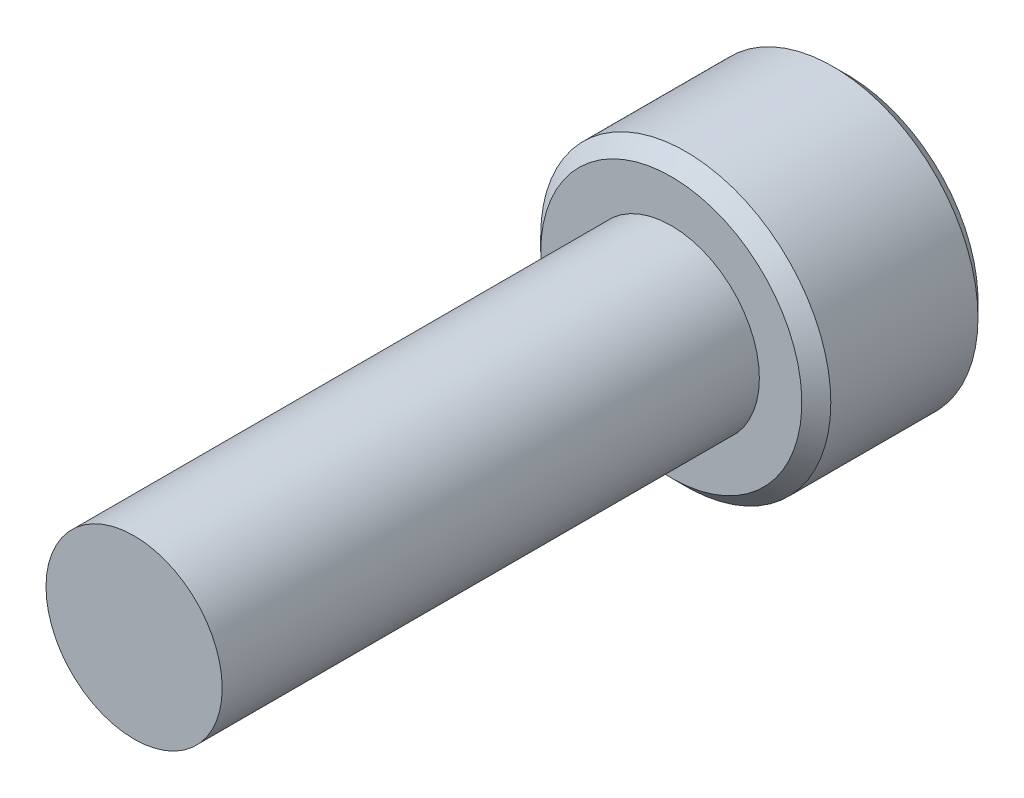
ISO-10303-21;
HEADER;
FILE_DESCRIPTION(('STEP AP214'),'2;1');
FILE_NAME('part.step','',(''),(''),'','','');
FILE_SCHEMA(('AUTOMOTIVE_DESIGN { 1 0 10303 214 1 1 1 1 }'));
ENDSEC;
DATA;
#1=APPLICATION_CONTEXT('core data for automotive mechanical design processes');
#2=APPLICATION_PROTOCOL_DEFINITION('international standard','automotive_design',2000,#1);
#3=PRODUCT_CONTEXT('',#1,'mechanical');
#4=PRODUCT('Part','Part','',(#3));
#5=PRODUCT_RELATED_PRODUCT_CATEGORY('part','',(#4));
#6=PRODUCT_DEFINITION_FORMATION('','',#4);
#7=PRODUCT_DEFINITION_CONTEXT('part definition',#1,'design');
#8=PRODUCT_DEFINITION('design','',#6,#7);
#9=PRODUCT_DEFINITION_SHAPE('','',#8);
#10=(LENGTH_UNIT() NAMED_UNIT(*) SI_UNIT(.MILLI.,.METRE.));
#11=(NAMED_UNIT(*) PLANE_ANGLE_UNIT() SI_UNIT($,.RADIAN.));
#12=(NAMED_UNIT(*) SI_UNIT($,.STERADIAN.) SOLID_ANGLE_UNIT());
#13=UNCERTAINTY_MEASURE_WITH_UNIT(LENGTH_MEASURE(1.E-05),#10,'distance_accuracy_value','');
#14=(GEOMETRIC_REPRESENTATION_CONTEXT(3) GLOBAL_UNCERTAINTY_ASSIGNED_CONTEXT((#13)) GLOBAL_UNIT_ASSIGNED_CONTEXT((#10,
#11,#12)) REPRESENTATION_CONTEXT('',''));
#15=CARTESIAN_POINT('',(0.,0.,0.));
#16=DIRECTION('',(0.,0.,1.));
#17=DIRECTION('',(1.,0.,0.));
#18=AXIS2_PLACEMENT_3D('',#15,#16,#17);
#19=CARTESIAN_POINT('',(0.,0.,-12.7));
#20=DIRECTION('',(0.,0.,1.));
#21=DIRECTION('',(1.,0.,0.));
#22=AXIS2_PLACEMENT_3D('',#19,#20,#21);
#23=CYLINDRICAL_SURFACE('',#22,2.0828);
#24=CARTESIAN_POINT('',(0.,0.,-12.7));
#25=DIRECTION('',(0.,0.,-1.));
#26=DIRECTION('',(-1.,0.,0.));
#27=AXIS2_PLACEMENT_3D('',#24,#25,#26);
#28=CIRCLE('',#27,2.0828);
#29=CARTESIAN_POINT('',(-2.0828,0.,-12.7));
#30=VERTEX_POINT('',#29);
#31=EDGE_CURVE('E200',#30,#30,#28,.F.);
#32=ORIENTED_EDGE('',*,*,#31,.T.);
#33=EDGE_LOOP('',(#32));
#34=FACE_BOUND('',#33,.T.);
#35=CARTESIAN_POINT('',(0.,0.,0.));
#36=DIRECTION('',(0.,0.,1.));
#37=DIRECTION('',(1.,0.,0.));
#38=AXIS2_PLACEMENT_3D('',#35,#36,#37);
#39=CIRCLE('',#38,2.0828);
#40=CARTESIAN_POINT('',(2.0828,0.,0.));
#41=VERTEX_POINT('',#40);
#42=EDGE_CURVE('E106',#41,#41,#39,.T.);
#43=ORIENTED_EDGE('',*,*,#42,.F.);
#44=EDGE_LOOP('',(#43));
#45=FACE_BOUND('',#44,.T.);
#46=ADVANCED_FACE('F32',(#34,#45),#23,.T.);
#47=CARTESIAN_POINT('',(0.,0.,0.));
#48=DIRECTION('',(0.,0.,1.));
#49=DIRECTION('',(1.,0.,0.));
#50=AXIS2_PLACEMENT_3D('',#47,#48,#49);
#51=PLANE('',#50);
#52=ORIENTED_EDGE('',*,*,#42,.T.);
#53=EDGE_LOOP('',(#52));
#54=FACE_BOUND('',#53,.T.);
#55=ADVANCED_FACE('F187',(#54),#51,.T.);
#56=CARTESIAN_POINT('',(0.,0.,-16.8656));
#57=DIRECTION('',(0.,0.,1.));
#58=DIRECTION('',(1.,0.,0.));
#59=AXIS2_PLACEMENT_3D('',#56,#57,#58);
#60=CYLINDRICAL_SURFACE('',#59,3.429);
#61=CARTESIAN_POINT('',(0.,0.,-16.5227));
#62=DIRECTION('',(0.,0.,-1.));
#63=DIRECTION('',(-1.,0.,0.));
#64=AXIS2_PLACEMENT_3D('',#61,#62,#63);
#65=CIRCLE('',#64,3.429);
#66=CARTESIAN_POINT('',(-3.429,0.,-16.5227));
#67=VERTEX_POINT('',#66);
#68=EDGE_CURVE('E40',#67,#67,#65,.F.);
#69=ORIENTED_EDGE('',*,*,#68,.T.);
#70=EDGE_LOOP('',(#69));
#71=FACE_BOUND('',#70,.T.);
#72=CARTESIAN_POINT('',(0.,0.,-13.0429));
#73=DIRECTION('',(0.,0.,-1.));
#74=DIRECTION('',(-1.,0.,0.));
#75=AXIS2_PLACEMENT_3D('',#72,#73,#74);
#76=CIRCLE('',#75,3.429);
#77=CARTESIAN_POINT('',(-3.429,0.,-13.0429));
#78=VERTEX_POINT('',#77);
#79=EDGE_CURVE('E166',#78,#78,#76,.T.);
#80=ORIENTED_EDGE('',*,*,#79,.T.);
#81=EDGE_LOOP('',(#80));
#82=FACE_BOUND('',#81,.T.);
#83=ADVANCED_FACE('F171',(#71,#82),#60,.T.);
#84=CARTESIAN_POINT('',(0.,0.,-16.8656));
#85=DIRECTION('',(0.,0.,-1.));
#86=DIRECTION('',(-1.,0.,0.));
#87=AXIS2_PLACEMENT_3D('',#84,#85,#86);
#88=PLANE('',#87);
#89=CARTESIAN_POINT('',(0.,0.,-16.8656));
#90=DIRECTION('',(0.,0.,-1.));
#91=DIRECTION('',(-1.,0.,0.));
#92=AXIS2_PLACEMENT_3D('',#89,#90,#91);
#93=CIRCLE('',#92,3.0861);
#94=CARTESIAN_POINT('',(-3.0861,0.,-16.8656));
#95=VERTEX_POINT('',#94);
#96=EDGE_CURVE('E105',#95,#95,#93,.T.);
#97=ORIENTED_EDGE('',*,*,#96,.T.);
#98=EDGE_LOOP('',(#97));
#99=FACE_BOUND('',#98,.T.);
#100=CARTESIAN_POINT('',(0.,0.,-16.8656));
#101=DIRECTION('',(0.,0.,-1.));
#102=DIRECTION('',(-1.,0.,0.));
#103=AXIS2_PLACEMENT_3D('',#100,#101,#102);
#104=CIRCLE('',#103,2.06222299276169);
#105=CARTESIAN_POINT('',(-1.7859375,1.03111149638085,-16.8656));
#106=VERTEX_POINT('',#105);
#107=CARTESIAN_POINT('',(0.,2.06222299276169,-16.8656));
#108=VERTEX_POINT('',#107);
#109=EDGE_CURVE('E86',#106,#108,#104,.T.);
#110=ORIENTED_EDGE('',*,*,#109,.F.);
#111=CARTESIAN_POINT('',(-1.7859375,-1.03111149638085,-16.8656));
#112=VERTEX_POINT('',#111);
#113=EDGE_CURVE('E46',#112,#106,#104,.T.);
#114=ORIENTED_EDGE('',*,*,#113,.F.);
#115=CARTESIAN_POINT('',(0.,-2.06222299276169,-16.8656));
#116=VERTEX_POINT('',#115);
#117=EDGE_CURVE('E256',#116,#112,#104,.T.);
#118=ORIENTED_EDGE('',*,*,#117,.F.);
#119=CARTESIAN_POINT('',(1.7859375,-1.03111149638085,-16.8656));
#120=VERTEX_POINT('',#119);
#121=EDGE_CURVE('E53',#120,#116,#104,.T.);
#122=ORIENTED_EDGE('',*,*,#121,.F.);
#123=CARTESIAN_POINT('',(1.7859375,1.03111149638085,-16.8656));
#124=VERTEX_POINT('',#123);
#125=EDGE_CURVE('E127',#124,#120,#104,.T.);
#126=ORIENTED_EDGE('',*,*,#125,.F.);
#127=EDGE_CURVE('E95',#108,#124,#104,.T.);
#128=ORIENTED_EDGE('',*,*,#127,.F.);
#129=EDGE_LOOP('',(#110,#114,#118,#122,#126,#128));
#130=FACE_BOUND('',#129,.T.);
#131=ADVANCED_FACE('F126',(#99,#130),#88,.T.);
#132=CARTESIAN_POINT('',(0.,0.,-12.7));
#133=DIRECTION('',(0.,0.,-1.));
#134=DIRECTION('',(-1.,0.,0.));
#135=AXIS2_PLACEMENT_3D('',#132,#133,#134);
#136=PLANE('',#135);
#137=CARTESIAN_POINT('',(0.,0.,-12.7));
#138=DIRECTION('',(0.,0.,-1.));
#139=DIRECTION('',(-1.,0.,0.));
#140=AXIS2_PLACEMENT_3D('',#137,#138,#139);
#141=CIRCLE('',#140,3.0861);
#142=CARTESIAN_POINT('',(-3.0861,0.,-12.7));
#143=VERTEX_POINT('',#142);
#144=EDGE_CURVE('E11',#143,#143,#141,.F.);
#145=ORIENTED_EDGE('',*,*,#144,.T.);
#146=EDGE_LOOP('',(#145));
#147=FACE_BOUND('',#146,.T.);
#148=ORIENTED_EDGE('',*,*,#31,.F.);
#149=EDGE_LOOP('',(#148));
#150=FACE_BOUND('',#149,.T.);
#151=ADVANCED_FACE('F180',(#147,#150),#136,.F.);
#152=CARTESIAN_POINT('',(0.,0.,-16.8656));
#153=DIRECTION('',(0.,0.,-1.));
#154=DIRECTION('',(-1.,0.,0.));
#155=AXIS2_PLACEMENT_3D('',#152,#153,#154);
#156=CONICAL_SURFACE('',#155,2.06222299276169,0.78539816339745);
#157=ORIENTED_EDGE('',*,*,#127,.T.);
#158=CARTESIAN_POINT('',(-0.000199999999999837,2.06233846281553,-16.8657154797516));
#159=CARTESIAN_POINT('',(0.0611956015759165,2.02689169571862,-16.8302968302053));
#160=CARTESIAN_POINT('',(0.123617860874083,1.9908521875094,-16.7969581781509));
#161=CARTESIAN_POINT('',(0.250903960535891,1.91736352360555,-16.7359155592055));
#162=CARTESIAN_POINT('',(0.315779909798269,1.87990737683499,-16.7082455621251));
#163=CARTESIAN_POINT('',(0.446599209311714,1.8043788190457,-16.6608461265527));
#164=CARTESIAN_POINT('',(0.512509233513534,1.76632564883049,-16.6409975342861));
#165=CARTESIAN_POINT('',(0.645780477682402,1.68938146013435,-16.6104164816143));
#166=CARTESIAN_POINT('',(0.713137624857635,1.65049279308089,-16.5996611886412));
#167=CARTESIAN_POINT('',(0.829220820670577,1.58347212872989,-16.5899572559589));
#168=CARTESIAN_POINT('',(0.877796848686671,1.55542674587864,-16.588520545453));
#169=CARTESIAN_POINT('',(0.974869540343765,1.49938180121946,-16.5909394477888));
#170=CARTESIAN_POINT('',(1.02336617019129,1.4713822589222,-16.5947969161715));
#171=CARTESIAN_POINT('',(1.11988817846821,1.4156552514608,-16.6075828827439));
#172=CARTESIAN_POINT('',(1.16791312509815,1.38792803559618,-16.6165156537155));
#173=CARTESIAN_POINT('',(1.26315922323818,1.33293767519577,-16.6389673141422));
#174=CARTESIAN_POINT('',(1.31037998091306,1.30567475804084,-16.652488386438));
#175=CARTESIAN_POINT('',(1.43132294865621,1.23584830305774,-16.6926273746341));
#176=CARTESIAN_POINT('',(1.50429529371242,1.19371769999614,-16.7222707839069));
#177=CARTESIAN_POINT('',(1.61159442773943,1.13176851608183,-16.772313490254));
#178=CARTESIAN_POINT('',(1.64695424171411,1.11135351796506,-16.789896283774));
#179=CARTESIAN_POINT('',(1.71701878052223,1.07090173762355,-16.8266647691481));
#180=CARTESIAN_POINT('',(1.75172389195438,1.05086473219594,-16.845849476289));
#181=CARTESIAN_POINT('',(1.7861375,1.03099602632701,-16.8657154797516));
#182=B_SPLINE_CURVE_WITH_KNOTS('',3,(#158,#159,#160,#161,#162,#163,#164,#165,#166,#167,#168,
#169,#170,#171,#172,#173,#174,#175,#176,#177,#178,#179,#180,#181),.UNSPECIFIED.,.F.,.F.,(4,2,2,
2,2,2,2,2,2,2,2,4),(0.,0.237911140423802,0.47720876767363,0.712705150046278,0.947608448198473,
1.11569769827263,1.28384587649986,1.45213582505427,1.62050594845156,1.88791495712909,
2.02125696737758,2.15451760593925),.UNSPECIFIED.);
#183=EDGE_CURVE('E100',#108,#124,#182,.T.);
#184=ORIENTED_EDGE('',*,*,#183,.F.);
#185=EDGE_LOOP('',(#157,#184));
#186=FACE_BOUND('',#185,.T.);
#187=ADVANCED_FACE('F101',(#186),#156,.F.);
#188=ORIENTED_EDGE('',*,*,#125,.T.);
#189=CARTESIAN_POINT('',(1.7859375,-2.0564571794204,-17.5270856709349));
#190=CARTESIAN_POINT('',(1.7859375,-2.00638471909862,-17.4892880169957));
#191=CARTESIAN_POINT('',(1.7859375,-1.9560318889355,-17.4518564486687));
#192=CARTESIAN_POINT('',(1.7859375,-1.85465493232354,-17.3778876153243));
#193=CARTESIAN_POINT('',(1.7859375,-1.80363064053091,-17.3413505771645));
#194=CARTESIAN_POINT('',(1.7859375,-1.7004269625614,-17.2690731528572));
#195=CARTESIAN_POINT('',(1.7859375,-1.64824168967413,-17.233341132932));
#196=CARTESIAN_POINT('',(1.7859375,-1.54298521924056,-17.1632166560612));
#197=CARTESIAN_POINT('',(1.7859375,-1.48991408466505,-17.1288241044749));
#198=CARTESIAN_POINT('',(1.7859375,-1.32304925075432,-17.0242275506123));
#199=CARTESIAN_POINT('',(1.7859375,-1.20747518485095,-16.9568130981851));
#200=CARTESIAN_POINT('',(1.7859375,-0.970563462349316,-16.8334971938958));
#201=CARTESIAN_POINT('',(1.7859375,-0.849247003266681,-16.7775569298341));
#202=CARTESIAN_POINT('',(1.7859375,-0.667147590400393,-16.7091193208198));
#203=CARTESIAN_POINT('',(1.7859375,-0.609061867992985,-16.6894772551934));
#204=CARTESIAN_POINT('',(1.7859375,-0.491488306301484,-16.654856417184));
#205=CARTESIAN_POINT('',(1.7859375,-0.432000370727959,-16.639877966059));
#206=CARTESIAN_POINT('',(1.7859375,-0.312971553025677,-16.6156118427828));
#207=CARTESIAN_POINT('',(1.7859375,-0.253450864331209,-16.6062266687623));
#208=CARTESIAN_POINT('',(1.7859375,-0.133772958047114,-16.5933303326389));
#209=CARTESIAN_POINT('',(1.7859375,-0.0736158516653908,-16.5898181608047));
#210=CARTESIAN_POINT('',(1.7859375,0.0445641075801582,-16.5889283461994));
#211=CARTESIAN_POINT('',(1.7859375,0.102585397592693,-16.5913332609875));
#212=CARTESIAN_POINT('',(1.7859375,0.218130764261559,-16.6016652894478));
#213=CARTESIAN_POINT('',(1.7859375,0.275654792066328,-16.6095929395753));
#214=CARTESIAN_POINT('',(1.7859375,0.390762936235965,-16.6306721191996));
#215=CARTESIAN_POINT('',(1.7859375,0.448330524172478,-16.6439125456089));
#216=CARTESIAN_POINT('',(1.7859375,0.562208055257706,-16.6749135632709));
#217=CARTESIAN_POINT('',(1.7859375,0.618518103209719,-16.6926737763043));
#218=CARTESIAN_POINT('',(1.7859375,0.795802935443479,-16.7552710135077));
#219=CARTESIAN_POINT('',(1.7859375,0.914253068308211,-16.8072371701309));
#220=CARTESIAN_POINT('',(1.7859375,1.14559793318386,-16.9227773029299));
#221=CARTESIAN_POINT('',(1.7859375,1.25847079443432,-16.9863929824275));
#222=CARTESIAN_POINT('',(1.7859375,1.42161019191199,-17.0856649974319));
#223=CARTESIAN_POINT('',(1.7859375,1.47364444169481,-17.1184728465278));
#224=CARTESIAN_POINT('',(1.7859375,1.57681993847581,-17.1854743669625));
#225=CARTESIAN_POINT('',(1.7859375,1.62796111741225,-17.2196681432703));
#226=CARTESIAN_POINT('',(1.7859375,1.7290523077583,-17.2889049280038));
#227=CARTESIAN_POINT('',(1.7859375,1.77900862061028,-17.3239387817349));
#228=CARTESIAN_POINT('',(1.7859375,1.8782385364545,-17.3949329715092));
#229=CARTESIAN_POINT('',(1.7859375,1.92751232341313,-17.4308930501216));
#230=CARTESIAN_POINT('',(1.7859375,1.9765003414196,-17.4672325501569));
#231=B_SPLINE_CURVE_WITH_KNOTS('',3,(#189,#190,#191,#192,#193,#194,#195,#196,#197,#198,#199,
#200,#201,#202,#203,#204,#205,#206,#207,#208,#209,#210,#211,#212,#213,#214,#215,#216,#217,#218,
#219,#220,#221,#222,#223,#224,#225,#226,#227,#228,#229,#230),.UNSPECIFIED.,.F.,.F.,(4,2,2,2,2,2,
2,2,2,2,2,2,2,2,2,2,2,2,2,2,4),(0.,0.188213463007492,0.376474173620914,0.566193581980197,
0.75589956123407,1.15694956004514,1.55661975691516,1.74041450774975,1.92422191668029,
2.104723615629,2.28519427815575,2.45913267060715,2.63308796106198,2.81008419387739,
2.9870656203721,3.37397665720655,3.76230085312826,3.94682415462261,4.13136145796745,
4.31439974248597,4.49738769171718),.UNSPECIFIED.);
#232=EDGE_CURVE('E94',#124,#120,#231,.F.);
#233=ORIENTED_EDGE('',*,*,#232,.F.);
#234=EDGE_LOOP('',(#188,#233));
#235=FACE_BOUND('',#234,.T.);
#236=ADVANCED_FACE('F262',(#235),#156,.F.);
#237=ORIENTED_EDGE('',*,*,#121,.T.);
#238=CARTESIAN_POINT('',(1.7861375,-1.03099602632701,-16.8657154797516));
#239=CARTESIAN_POINT('',(1.72474189842408,-1.06644279342392,-16.8302968302053));
#240=CARTESIAN_POINT('',(1.66231963912592,-1.10248230163314,-16.7969581781509));
#241=CARTESIAN_POINT('',(1.53503353946411,-1.17597096553699,-16.7359155592055));
#242=CARTESIAN_POINT('',(1.47015759020173,-1.21342711230755,-16.7082455621251));
#243=CARTESIAN_POINT('',(1.33933829068829,-1.28895567009684,-16.6608461265528));
#244=CARTESIAN_POINT('',(1.27342826648647,-1.32700884031206,-16.6409975342861));
#245=CARTESIAN_POINT('',(1.1401570223176,-1.40395302900819,-16.6104164816143));
#246=CARTESIAN_POINT('',(1.07279987514237,-1.44284169606165,-16.5996611886412));
#247=CARTESIAN_POINT('',(0.956716679329423,-1.50986236041265,-16.5899572559589));
#248=CARTESIAN_POINT('',(0.908140651313329,-1.5379077432639,-16.588520545453));
#249=CARTESIAN_POINT('',(0.811067959656236,-1.59395268792309,-16.5909394477888));
#250=CARTESIAN_POINT('',(0.762571329808712,-1.62195223022034,-16.5947969161715));
#251=CARTESIAN_POINT('',(0.666049321531796,-1.67767923768175,-16.6075828827439));
#252=CARTESIAN_POINT('',(0.618024374901855,-1.70540645354636,-16.6165156537155));
#253=CARTESIAN_POINT('',(0.522778276761816,-1.76039681394677,-16.6389673141422));
#254=CARTESIAN_POINT('',(0.475557519086938,-1.7876597311017,-16.652488386438));
#255=CARTESIAN_POINT('',(0.354614551343791,-1.8574861860848,-16.6926273746341));
#256=CARTESIAN_POINT('',(0.281642206287579,-1.8996167891464,-16.7222707839069));
#257=CARTESIAN_POINT('',(0.17434307226057,-1.96156597306071,-16.772313490254));
#258=CARTESIAN_POINT('',(0.138983258285892,-1.98198097117748,-16.789896283774));
#259=CARTESIAN_POINT('',(0.0689187194777749,-2.022432751519,-16.8266647691481));
#260=CARTESIAN_POINT('',(0.0342136080456218,-2.04246975694661,-16.845849476289));
#261=CARTESIAN_POINT('',(-0.000199999999999378,-2.06233846281553,-16.8657154797516));
#262=B_SPLINE_CURVE_WITH_KNOTS('',3,(#238,#239,#240,#241,#242,#243,#244,#245,#246,#247,#248,
#249,#250,#251,#252,#253,#254,#255,#256,#257,#258,#259,#260,#261),.UNSPECIFIED.,.F.,.F.,(4,2,2,
2,2,2,2,2,2,2,2,4),(0.,0.237911140423801,0.477208767673629,0.712705150046278,0.947608448198473,
1.11569769827263,1.28384587649986,1.45213582505427,1.62050594845156,1.88791495712909,
2.02125696737758,2.15451760593925),.UNSPECIFIED.);
#263=EDGE_CURVE('E136',#120,#116,#262,.T.);
#264=ORIENTED_EDGE('',*,*,#263,.F.);
#265=EDGE_LOOP('',(#237,#264));
#266=FACE_BOUND('',#265,.T.);
#267=ADVANCED_FACE('F259',(#266),#156,.F.);
#268=ORIENTED_EDGE('',*,*,#117,.T.);
#269=CARTESIAN_POINT('',(0.00020000000000003,-2.06233846281553,-16.8657154797516));
#270=CARTESIAN_POINT('',(-0.0611956015759167,-2.02689169571862,-16.8302968302053));
#271=CARTESIAN_POINT('',(-0.123617860874083,-1.9908521875094,-16.7969581781509));
#272=CARTESIAN_POINT('',(-0.250903960535891,-1.91736352360555,-16.7359155592055));
#273=CARTESIAN_POINT('',(-0.315779909798269,-1.87990737683499,-16.7082455621251));
#274=CARTESIAN_POINT('',(-0.446599209311714,-1.8043788190457,-16.6608461265527));
#275=CARTESIAN_POINT('',(-0.512509233513534,-1.76632564883049,-16.6409975342861));
#276=CARTESIAN_POINT('',(-0.645780477682402,-1.68938146013435,-16.6104164816143));
#277=CARTESIAN_POINT('',(-0.713137624857635,-1.65049279308089,-16.5996611886412));
#278=CARTESIAN_POINT('',(-0.829220820670577,-1.58347212872989,-16.5899572559589));
#279=CARTESIAN_POINT('',(-0.877796848686671,-1.55542674587864,-16.588520545453));
#280=CARTESIAN_POINT('',(-0.974869540343765,-1.49938180121946,-16.5909394477888));
#281=CARTESIAN_POINT('',(-1.02336617019129,-1.4713822589222,-16.5947969161715));
#282=CARTESIAN_POINT('',(-1.11988817846821,-1.4156552514608,-16.6075828827439));
#283=CARTESIAN_POINT('',(-1.16791312509815,-1.38792803559618,-16.6165156537155));
#284=CARTESIAN_POINT('',(-1.26315922323818,-1.33293767519577,-16.6389673141422));
#285=CARTESIAN_POINT('',(-1.31037998091306,-1.30567475804084,-16.652488386438));
#286=CARTESIAN_POINT('',(-1.43132294865621,-1.23584830305774,-16.6926273746341));
#287=CARTESIAN_POINT('',(-1.50429529371242,-1.19371769999614,-16.7222707839069));
#288=CARTESIAN_POINT('',(-1.61159442773943,-1.13176851608183,-16.772313490254));
#289=CARTESIAN_POINT('',(-1.64695424171411,-1.11135351796506,-16.789896283774));
#290=CARTESIAN_POINT('',(-1.71701878052223,-1.07090173762355,-16.8266647691481));
#291=CARTESIAN_POINT('',(-1.75172389195438,-1.05086473219594,-16.845849476289));
#292=CARTESIAN_POINT('',(-1.7861375,-1.03099602632701,-16.8657154797516));
#293=B_SPLINE_CURVE_WITH_KNOTS('',3,(#269,#270,#271,#272,#273,#274,#275,#276,#277,#278,#279,
#280,#281,#282,#283,#284,#285,#286,#287,#288,#289,#290,#291,#292),.UNSPECIFIED.,.F.,.F.,(4,2,2,
2,2,2,2,2,2,2,2,4),(0.,0.237911140423802,0.47720876767363,0.712705150046278,0.947608448198473,
1.11569769827263,1.28384587649986,1.45213582505427,1.62050594845156,1.88791495712909,
2.02125696737758,2.15451760593925),.UNSPECIFIED.);
#294=EDGE_CURVE('E234',#116,#112,#293,.T.);
#295=ORIENTED_EDGE('',*,*,#294,.F.);
#296=EDGE_LOOP('',(#268,#295));
#297=FACE_BOUND('',#296,.T.);
#298=ADVANCED_FACE('F258',(#297),#156,.F.);
#299=ORIENTED_EDGE('',*,*,#113,.T.);
#300=CARTESIAN_POINT('',(-1.7859375,-2.05645717971961,-17.5270856711608));
#301=CARTESIAN_POINT('',(-1.7859375,-2.00638471938943,-17.4892880172129));
#302=CARTESIAN_POINT('',(-1.7859375,-1.95603188921789,-17.4518564488772));
#303=CARTESIAN_POINT('',(-1.7859375,-1.854654932589,-17.3778876155155));
#304=CARTESIAN_POINT('',(-1.7859375,-1.80363064078787,-17.3413505773471));
#305=CARTESIAN_POINT('',(-1.7859375,-1.70042696280105,-17.2690731530224));
#306=CARTESIAN_POINT('',(-1.7859375,-1.64824168990499,-17.2333411330885));
#307=CARTESIAN_POINT('',(-1.7859375,-1.54298521945367,-17.1632166562004));
#308=CARTESIAN_POINT('',(-1.7859375,-1.4899140848692,-17.1288241046057));
#309=CARTESIAN_POINT('',(-1.7859375,-1.32304925092892,-17.0242275507158));
#310=CARTESIAN_POINT('',(-1.7859375,-1.20747518500455,-16.9568130982705));
#311=CARTESIAN_POINT('',(-1.7859375,-0.970563462459106,-16.8334971939475));
#312=CARTESIAN_POINT('',(-1.7859375,-0.849247003353688,-16.7775569298703));
#313=CARTESIAN_POINT('',(-1.7859375,-0.667147590470259,-16.7091193208444));
#314=CARTESIAN_POINT('',(-1.7859375,-0.609061868070028,-16.6894772552185));
#315=CARTESIAN_POINT('',(-1.7859375,-0.491488306393119,-16.6548564172086));
#316=CARTESIAN_POINT('',(-1.7859375,-0.432000370827006,-16.6398779660825));
#317=CARTESIAN_POINT('',(-1.7859375,-0.312971553139305,-16.6156118428026));
#318=CARTESIAN_POINT('',(-1.7859375,-0.253450864452002,-16.6062266687795));
#319=CARTESIAN_POINT('',(-1.7859375,-0.133772958181996,-16.5933303326493));
#320=CARTESIAN_POINT('',(-1.7859375,-0.0736158518071977,-16.5898181608107));
#321=CARTESIAN_POINT('',(-1.7859375,0.0445641074255746,-16.5889283461957));
#322=CARTESIAN_POINT('',(-1.7859375,0.102585397432239,-16.5913332609785));
#323=CARTESIAN_POINT('',(-1.7859375,0.218130764089954,-16.6016652894271));
#324=CARTESIAN_POINT('',(-1.7859375,0.27565479188944,-16.6095929395484));
#325=CARTESIAN_POINT('',(-1.7859375,0.390762936048649,-16.6306721191597));
#326=CARTESIAN_POINT('',(-1.7859375,0.448330523980032,-16.6439125455621));
#327=CARTESIAN_POINT('',(-1.7859375,0.562208055055495,-16.6749135632103));
#328=CARTESIAN_POINT('',(-1.7859375,0.618518103002873,-16.6926737762366));
#329=CARTESIAN_POINT('',(-1.7859375,0.795802935191591,-16.755271013407));
#330=CARTESIAN_POINT('',(-1.7859375,0.914253068018178,-16.8072371699997));
#331=CARTESIAN_POINT('',(-1.7859375,1.14559793282046,-16.9227773027346));
#332=CARTESIAN_POINT('',(-1.7859375,1.25847079403572,-16.9863929821984));
#333=CARTESIAN_POINT('',(-1.7859375,1.42161019146454,-17.0856649971533));
#334=CARTESIAN_POINT('',(-1.7859375,1.47364444123306,-17.118472846234));
#335=CARTESIAN_POINT('',(-1.7859375,1.57681993798568,-17.1854743666382));
#336=CARTESIAN_POINT('',(-1.7859375,1.62796111690803,-17.2196681429306));
#337=CARTESIAN_POINT('',(-1.7859375,1.72905230722623,-17.2889049276337));
#338=CARTESIAN_POINT('',(-1.7859375,1.77900862006446,-17.3239387813497));
#339=CARTESIAN_POINT('',(-1.7859375,1.87823853588126,-17.3949329710938));
#340=CARTESIAN_POINT('',(-1.7859375,1.92751232282623,-17.4308930496911));
#341=CARTESIAN_POINT('',(-1.7859375,1.97650034081906,-17.4672325497113));
#342=B_SPLINE_CURVE_WITH_KNOTS('',3,(#300,#301,#302,#303,#304,#305,#306,#307,#308,#309,#310,
#311,#312,#313,#314,#315,#316,#317,#318,#319,#320,#321,#322,#323,#324,#325,#326,#327,#328,#329,
#330,#331,#332,#333,#334,#335,#336,#337,#338,#339,#340,#341),.UNSPECIFIED.,.F.,.F.,(4,2,2,2,2,2,
2,2,2,2,2,2,2,2,2,2,2,2,2,2,4),(0.,0.188213463043314,0.376474173692571,0.566193582088359,
0.755899561378738,1.15694956027169,1.5566197572228,1.74041450803663,1.92422191694645,
2.10472361587529,2.28519427838217,2.45913267081537,2.63308796125199,2.8100841940478,
2.98706562052293,3.37397665721653,3.76230085299648,3.94682415443018,4.13136145771436,
4.31439974217306,4.49738769134445),.UNSPECIFIED.);
#343=EDGE_CURVE('E116',#112,#106,#342,.T.);
#344=ORIENTED_EDGE('',*,*,#343,.F.);
#345=EDGE_LOOP('',(#299,#344));
#346=FACE_BOUND('',#345,.T.);
#347=ADVANCED_FACE('F271',(#346),#156,.F.);
#348=ORIENTED_EDGE('',*,*,#109,.T.);
#349=CARTESIAN_POINT('',(-1.7861375,1.03099602632701,-16.8657154797516));
#350=CARTESIAN_POINT('',(-1.72474189842408,1.06644279342392,-16.8302968302053));
#351=CARTESIAN_POINT('',(-1.66231963912592,1.10248230163314,-16.7969581781509));
#352=CARTESIAN_POINT('',(-1.53503353946411,1.17597096553699,-16.7359155592055));
#353=CARTESIAN_POINT('',(-1.47015759020173,1.21342711230755,-16.7082455621251));
#354=CARTESIAN_POINT('',(-1.33933829068829,1.28895567009684,-16.6608461265527));
#355=CARTESIAN_POINT('',(-1.27342826648647,1.32700884031205,-16.6409975342861));
#356=CARTESIAN_POINT('',(-1.1401570223176,1.40395302900819,-16.6104164816143));
#357=CARTESIAN_POINT('',(-1.07279987514236,1.44284169606165,-16.5996611886412));
#358=CARTESIAN_POINT('',(-0.956716679329423,1.50986236041265,-16.5899572559589));
#359=CARTESIAN_POINT('',(-0.908140651313328,1.5379077432639,-16.588520545453));
#360=CARTESIAN_POINT('',(-0.811067959656235,1.59395268792309,-16.5909394477888));
#361=CARTESIAN_POINT('',(-0.762571329808711,1.62195223022034,-16.5947969161715));
#362=CARTESIAN_POINT('',(-0.666049321531794,1.67767923768175,-16.6075828827439));
#363=CARTESIAN_POINT('',(-0.618024374901854,1.70540645354636,-16.6165156537155));
#364=CARTESIAN_POINT('',(-0.522778276761816,1.76039681394677,-16.6389673141422));
#365=CARTESIAN_POINT('',(-0.475557519086938,1.7876597311017,-16.652488386438));
#366=CARTESIAN_POINT('',(-0.354614551343791,1.8574861860848,-16.6926273746341));
#367=CARTESIAN_POINT('',(-0.281642206287578,1.8996167891464,-16.7222707839069));
#368=CARTESIAN_POINT('',(-0.174343072260569,1.96156597306071,-16.772313490254));
#369=CARTESIAN_POINT('',(-0.138983258285892,1.98198097117748,-16.789896283774));
#370=CARTESIAN_POINT('',(-0.0689187194777745,2.022432751519,-16.8266647691481));
#371=CARTESIAN_POINT('',(-0.0342136080456212,2.04246975694661,-16.845849476289));
#372=CARTESIAN_POINT('',(0.000199999999999954,2.06233846281553,-16.8657154797516));
#373=B_SPLINE_CURVE_WITH_KNOTS('',3,(#349,#350,#351,#352,#353,#354,#355,#356,#357,#358,#359,
#360,#361,#362,#363,#364,#365,#366,#367,#368,#369,#370,#371,#372),.UNSPECIFIED.,.F.,.F.,(4,2,2,
2,2,2,2,2,2,2,2,4),(0.,0.237911140423802,0.47720876767363,0.712705150046278,0.947608448198473,
1.11569769827263,1.28384587649986,1.45213582505427,1.62050594845156,1.88791495712909,
2.02125696737758,2.15451760593925),.UNSPECIFIED.);
#374=EDGE_CURVE('E90',#106,#108,#373,.T.);
#375=ORIENTED_EDGE('',*,*,#374,.F.);
#376=EDGE_LOOP('',(#348,#375));
#377=FACE_BOUND('',#376,.T.);
#378=ADVANCED_FACE('F88',(#377),#156,.F.);
#379=CARTESIAN_POINT('',(1.7859375,3.09333448914254,-14.18669375));
#380=DIRECTION('',(0.,0.,-1.));
#381=DIRECTION('',(-1.,0.,0.));
#382=AXIS2_PLACEMENT_3D('',#379,#380,#381);
#383=PLANE('',#382);
#384=DIRECTION('',(0.866025403784439,0.5,0.));
#385=VECTOR('',#384,1.);
#386=CARTESIAN_POINT('',(-1.7859375,1.03111149638085,-14.18669375));
#387=LINE('',#386,#385);
#388=CARTESIAN_POINT('',(-1.7859375,1.03111149638085,-14.18669375));
#389=VERTEX_POINT('',#388);
#390=CARTESIAN_POINT('',(0.,2.06222299276169,-14.18669375));
#391=VERTEX_POINT('',#390);
#392=EDGE_CURVE('E115',#389,#391,#387,.T.);
#393=ORIENTED_EDGE('',*,*,#392,.T.);
#394=DIRECTION('',(0.866025403784439,-0.5,0.));
#395=VECTOR('',#394,1.);
#396=CARTESIAN_POINT('',(0.,2.06222299276169,-14.18669375));
#397=LINE('',#396,#395);
#398=CARTESIAN_POINT('',(1.7859375,1.03111149638085,-14.18669375));
#399=VERTEX_POINT('',#398);
#400=EDGE_CURVE('E120',#391,#399,#397,.T.);
#401=ORIENTED_EDGE('',*,*,#400,.T.);
#402=DIRECTION('',(0.,-1.,0.));
#403=VECTOR('',#402,1.);
#404=CARTESIAN_POINT('',(1.7859375,1.03111149638085,-14.18669375));
#405=LINE('',#404,#403);
#406=CARTESIAN_POINT('',(1.7859375,-1.03111149638085,-14.18669375));
#407=VERTEX_POINT('',#406);
#408=EDGE_CURVE('E222',#399,#407,#405,.T.);
#409=ORIENTED_EDGE('',*,*,#408,.T.);
#410=DIRECTION('',(-0.866025403784439,-0.5,0.));
#411=VECTOR('',#410,1.);
#412=CARTESIAN_POINT('',(1.7859375,-1.03111149638085,-14.18669375));
#413=LINE('',#412,#411);
#414=CARTESIAN_POINT('',(0.,-2.06222299276169,-14.18669375));
#415=VERTEX_POINT('',#414);
#416=EDGE_CURVE('E219',#407,#415,#413,.T.);
#417=ORIENTED_EDGE('',*,*,#416,.T.);
#418=DIRECTION('',(-0.866025403784439,0.5,0.));
#419=VECTOR('',#418,1.);
#420=CARTESIAN_POINT('',(0.,-2.06222299276169,-14.18669375));
#421=LINE('',#420,#419);
#422=CARTESIAN_POINT('',(-1.7859375,-1.03111149638085,-14.18669375));
#423=VERTEX_POINT('',#422);
#424=EDGE_CURVE('E216',#415,#423,#421,.T.);
#425=ORIENTED_EDGE('',*,*,#424,.T.);
#426=DIRECTION('',(0.,1.,0.));
#427=VECTOR('',#426,1.);
#428=CARTESIAN_POINT('',(-1.7859375,-1.03111149638085,-14.18669375));
#429=LINE('',#428,#427);
#430=EDGE_CURVE('E123',#423,#389,#429,.T.);
#431=ORIENTED_EDGE('',*,*,#430,.T.);
#432=EDGE_LOOP('',(#393,#401,#409,#417,#425,#431));
#433=FACE_BOUND('',#432,.T.);
#434=ADVANCED_FACE('F155',(#433),#383,.T.);
#435=CARTESIAN_POINT('',(0.,2.06222299276169,-14.18669375));
#436=DIRECTION('',(0.5,0.866025403784439,0.));
#437=DIRECTION('',(-0.866025403784439,0.5,0.));
#438=AXIS2_PLACEMENT_3D('',#435,#436,#437);
#439=PLANE('',#438);
#440=DIRECTION('',(0.,0.,-1.));
#441=VECTOR('',#440,1.);
#442=CARTESIAN_POINT('',(0.,2.06222299276169,-14.18669375));
#443=LINE('',#442,#441);
#444=EDGE_CURVE('E112',#391,#108,#443,.T.);
#445=ORIENTED_EDGE('',*,*,#444,.T.);
#446=ORIENTED_EDGE('',*,*,#183,.T.);
#447=DIRECTION('',(0.,0.,-1.));
#448=VECTOR('',#447,1.);
#449=CARTESIAN_POINT('',(1.7859375,1.03111149638085,-14.18669375));
#450=LINE('',#449,#448);
#451=EDGE_CURVE('E122',#399,#124,#450,.T.);
#452=ORIENTED_EDGE('',*,*,#451,.F.);
#453=ORIENTED_EDGE('',*,*,#400,.F.);
#454=EDGE_LOOP('',(#445,#446,#452,#453));
#455=FACE_BOUND('',#454,.T.);
#456=ADVANCED_FACE('F118',(#455),#439,.F.);
#457=CARTESIAN_POINT('',(1.7859375,1.03111149638085,-14.18669375));
#458=DIRECTION('',(1.,0.,0.));
#459=DIRECTION('',(0.,1.,0.));
#460=AXIS2_PLACEMENT_3D('',#457,#458,#459);
#461=PLANE('',#460);
#462=ORIENTED_EDGE('',*,*,#451,.T.);
#463=ORIENTED_EDGE('',*,*,#232,.T.);
#464=DIRECTION('',(0.,0.,-1.));
#465=VECTOR('',#464,1.);
#466=CARTESIAN_POINT('',(1.7859375,-1.03111149638085,-14.18669375));
#467=LINE('',#466,#465);
#468=EDGE_CURVE('E207',#407,#120,#467,.T.);
#469=ORIENTED_EDGE('',*,*,#468,.F.);
#470=ORIENTED_EDGE('',*,*,#408,.F.);
#471=EDGE_LOOP('',(#462,#463,#469,#470));
#472=FACE_BOUND('',#471,.T.);
#473=ADVANCED_FACE('F144',(#472),#461,.F.);
#474=CARTESIAN_POINT('',(1.7859375,-1.03111149638085,-14.18669375));
#475=DIRECTION('',(0.5,-0.866025403784439,0.));
#476=DIRECTION('',(0.866025403784439,0.5,0.));
#477=AXIS2_PLACEMENT_3D('',#474,#475,#476);
#478=PLANE('',#477);
#479=ORIENTED_EDGE('',*,*,#468,.T.);
#480=ORIENTED_EDGE('',*,*,#263,.T.);
#481=DIRECTION('',(0.,0.,-1.));
#482=VECTOR('',#481,1.);
#483=CARTESIAN_POINT('',(0.,-2.06222299276169,-14.18669375));
#484=LINE('',#483,#482);
#485=EDGE_CURVE('E210',#415,#116,#484,.T.);
#486=ORIENTED_EDGE('',*,*,#485,.F.);
#487=ORIENTED_EDGE('',*,*,#416,.F.);
#488=EDGE_LOOP('',(#479,#480,#486,#487));
#489=FACE_BOUND('',#488,.T.);
#490=ADVANCED_FACE('F148',(#489),#478,.F.);
#491=CARTESIAN_POINT('',(0.,-2.06222299276169,-14.18669375));
#492=DIRECTION('',(-0.5,-0.866025403784439,0.));
#493=DIRECTION('',(0.866025403784439,-0.5,0.));
#494=AXIS2_PLACEMENT_3D('',#491,#492,#493);
#495=PLANE('',#494);
#496=ORIENTED_EDGE('',*,*,#485,.T.);
#497=ORIENTED_EDGE('',*,*,#294,.T.);
#498=DIRECTION('',(0.,0.,-1.));
#499=VECTOR('',#498,1.);
#500=CARTESIAN_POINT('',(-1.7859375,-1.03111149638085,-14.18669375));
#501=LINE('',#500,#499);
#502=EDGE_CURVE('E203',#423,#112,#501,.T.);
#503=ORIENTED_EDGE('',*,*,#502,.F.);
#504=ORIENTED_EDGE('',*,*,#424,.F.);
#505=EDGE_LOOP('',(#496,#497,#503,#504));
#506=FACE_BOUND('',#505,.T.);
#507=ADVANCED_FACE('F241',(#506),#495,.F.);
#508=CARTESIAN_POINT('',(-1.7859375,-1.03111149638085,-14.18669375));
#509=DIRECTION('',(-1.,0.,0.));
#510=DIRECTION('',(0.,-1.,0.));
#511=AXIS2_PLACEMENT_3D('',#508,#509,#510);
#512=PLANE('',#511);
#513=ORIENTED_EDGE('',*,*,#502,.T.);
#514=ORIENTED_EDGE('',*,*,#343,.T.);
#515=DIRECTION('',(0.,0.,-1.));
#516=VECTOR('',#515,1.);
#517=CARTESIAN_POINT('',(-1.7859375,1.03111149638085,-14.18669375));
#518=LINE('',#517,#516);
#519=EDGE_CURVE('E114',#389,#106,#518,.T.);
#520=ORIENTED_EDGE('',*,*,#519,.F.);
#521=ORIENTED_EDGE('',*,*,#430,.F.);
#522=EDGE_LOOP('',(#513,#514,#520,#521));
#523=FACE_BOUND('',#522,.T.);
#524=ADVANCED_FACE('F238',(#523),#512,.F.);
#525=CARTESIAN_POINT('',(-1.7859375,1.03111149638085,-14.18669375));
#526=DIRECTION('',(-0.5,0.866025403784439,0.));
#527=DIRECTION('',(-0.866025403784439,-0.5,0.));
#528=AXIS2_PLACEMENT_3D('',#525,#526,#527);
#529=PLANE('',#528);
#530=ORIENTED_EDGE('',*,*,#519,.T.);
#531=ORIENTED_EDGE('',*,*,#374,.T.);
#532=ORIENTED_EDGE('',*,*,#444,.F.);
#533=ORIENTED_EDGE('',*,*,#392,.F.);
#534=EDGE_LOOP('',(#530,#531,#532,#533));
#535=FACE_BOUND('',#534,.T.);
#536=ADVANCED_FACE('F110',(#535),#529,.F.);
#537=CARTESIAN_POINT('',(0.,0.,-16.8656));
#538=DIRECTION('',(0.,0.,1.));
#539=DIRECTION('',(1.,0.,0.));
#540=AXIS2_PLACEMENT_3D('',#537,#538,#539);
#541=CONICAL_SURFACE('',#540,3.0861,0.785398163397446);
#542=ORIENTED_EDGE('',*,*,#68,.F.);
#543=EDGE_LOOP('',(#542));
#544=FACE_BOUND('',#543,.T.);
#545=ORIENTED_EDGE('',*,*,#96,.F.);
#546=EDGE_LOOP('',(#545));
#547=FACE_BOUND('',#546,.T.);
#548=ADVANCED_FACE('F174',(#544,#547),#541,.T.);
#549=CARTESIAN_POINT('',(0.,0.,-13.0429));
#550=DIRECTION('',(0.,0.,-1.));
#551=DIRECTION('',(-1.,0.,0.));
#552=AXIS2_PLACEMENT_3D('',#549,#550,#551);
#553=CONICAL_SURFACE('',#552,3.429,0.785398163397454);
#554=ORIENTED_EDGE('',*,*,#144,.F.);
#555=EDGE_LOOP('',(#554));
#556=FACE_BOUND('',#555,.T.);
#557=ORIENTED_EDGE('',*,*,#79,.F.);
#558=EDGE_LOOP('',(#557));
#559=FACE_BOUND('',#558,.T.);
#560=ADVANCED_FACE('F34',(#556,#559),#553,.T.);
#561=CLOSED_SHELL('',(#46,#55,#83,#131,#151,#187,#236,#267,#298,#347,#378,#434,#456,#473,#490,
#507,#524,#536,#548,#560));
#562=MANIFOLD_SOLID_BREP('B2',#561);
#563=ADVANCED_BREP_SHAPE_REPRESENTATION('',(#18,#562),#14);
#564=SHAPE_DEFINITION_REPRESENTATION(#9,#563);
ENDSEC;
END-ISO-10303-21;
